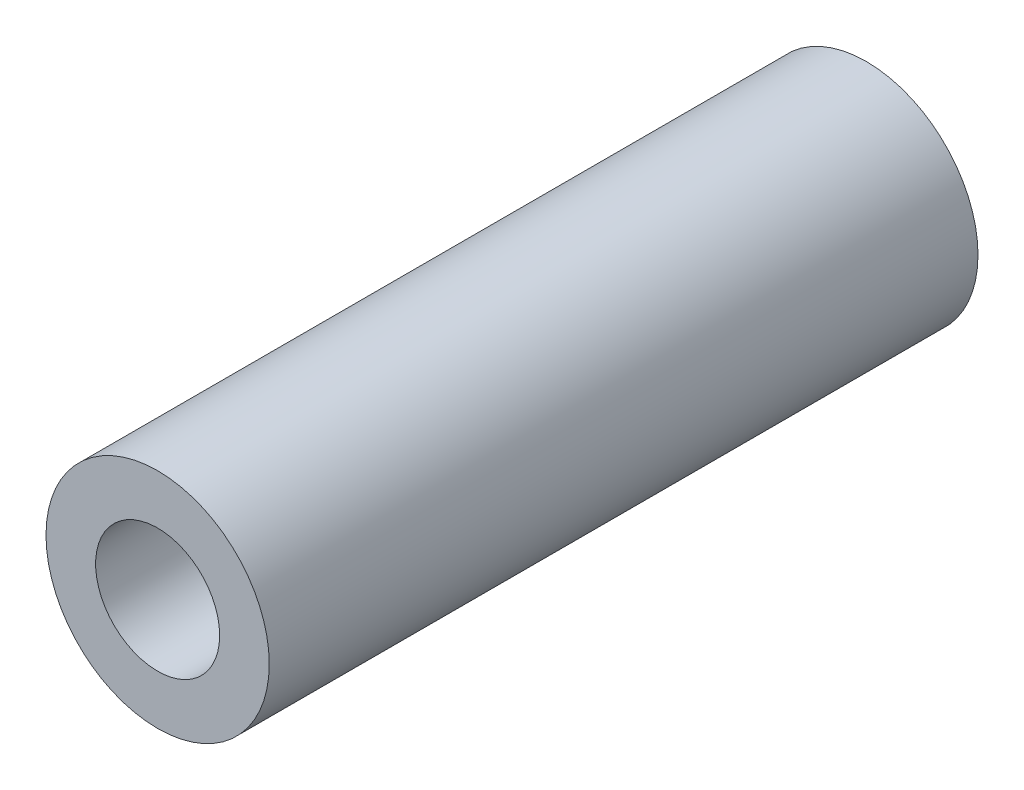
ISO-10303-21;
HEADER;
FILE_DESCRIPTION(('STEP AP214'),'2;1');
FILE_NAME('part.step','',(''),(''),'','','');
FILE_SCHEMA(('AUTOMOTIVE_DESIGN { 1 0 10303 214 1 1 1 1 }'));
ENDSEC;
DATA;
#1=APPLICATION_CONTEXT('core data for automotive mechanical design processes');
#2=APPLICATION_PROTOCOL_DEFINITION('international standard','automotive_design',2000,#1);
#3=PRODUCT_CONTEXT('',#1,'mechanical');
#4=PRODUCT('Part','Part','',(#3));
#5=PRODUCT_RELATED_PRODUCT_CATEGORY('part','',(#4));
#6=PRODUCT_DEFINITION_FORMATION('','',#4);
#7=PRODUCT_DEFINITION_CONTEXT('part definition',#1,'design');
#8=PRODUCT_DEFINITION('design','',#6,#7);
#9=PRODUCT_DEFINITION_SHAPE('','',#8);
#10=(LENGTH_UNIT() NAMED_UNIT(*) SI_UNIT(.MILLI.,.METRE.));
#11=(NAMED_UNIT(*) PLANE_ANGLE_UNIT() SI_UNIT($,.RADIAN.));
#12=(NAMED_UNIT(*) SI_UNIT($,.STERADIAN.) SOLID_ANGLE_UNIT());
#13=UNCERTAINTY_MEASURE_WITH_UNIT(LENGTH_MEASURE(1.E-05),#10,'distance_accuracy_value','');
#14=(GEOMETRIC_REPRESENTATION_CONTEXT(3) GLOBAL_UNCERTAINTY_ASSIGNED_CONTEXT((#13)) GLOBAL_UNIT_ASSIGNED_CONTEXT((#10,
#11,#12)) REPRESENTATION_CONTEXT('',''));
#15=CARTESIAN_POINT('',(0.,0.,0.));
#16=DIRECTION('',(0.,0.,1.));
#17=DIRECTION('',(1.,0.,0.));
#18=AXIS2_PLACEMENT_3D('',#15,#16,#17);
#19=CARTESIAN_POINT('',(0.,0.,20.));
#20=DIRECTION('',(0.,0.,1.));
#21=DIRECTION('',(1.,0.,0.));
#22=AXIS2_PLACEMENT_3D('',#19,#20,#21);
#23=PLANE('',#22);
#24=CARTESIAN_POINT('',(0.,0.,20.));
#25=DIRECTION('',(0.,0.,1.));
#26=DIRECTION('',(1.,0.,0.));
#27=AXIS2_PLACEMENT_3D('',#24,#25,#26);
#28=CIRCLE('',#27,3.15);
#29=CARTESIAN_POINT('',(3.15,0.,20.));
#30=VERTEX_POINT('',#29);
#31=EDGE_CURVE('E10',#30,#30,#28,.T.);
#32=ORIENTED_EDGE('',*,*,#31,.T.);
#33=EDGE_LOOP('',(#32));
#34=FACE_BOUND('',#33,.T.);
#35=CARTESIAN_POINT('',(0.,0.,20.));
#36=DIRECTION('',(0.,0.,1.));
#37=DIRECTION('',(1.,0.,0.));
#38=AXIS2_PLACEMENT_3D('',#35,#36,#37);
#39=CIRCLE('',#38,1.75);
#40=CARTESIAN_POINT('',(1.75,0.,20.));
#41=VERTEX_POINT('',#40);
#42=EDGE_CURVE('E42',#41,#41,#39,.T.);
#43=ORIENTED_EDGE('',*,*,#42,.F.);
#44=EDGE_LOOP('',(#43));
#45=FACE_BOUND('',#44,.T.);
#46=ADVANCED_FACE('F31',(#34,#45),#23,.T.);
#47=CARTESIAN_POINT('',(0.,0.,0.));
#48=DIRECTION('',(0.,0.,1.));
#49=DIRECTION('',(1.,0.,0.));
#50=AXIS2_PLACEMENT_3D('',#47,#48,#49);
#51=PLANE('',#50);
#52=CARTESIAN_POINT('',(0.,0.,0.));
#53=DIRECTION('',(0.,0.,1.));
#54=DIRECTION('',(1.,0.,0.));
#55=AXIS2_PLACEMENT_3D('',#52,#53,#54);
#56=CIRCLE('',#55,3.15);
#57=CARTESIAN_POINT('',(3.15,0.,0.));
#58=VERTEX_POINT('',#57);
#59=EDGE_CURVE('E35',#58,#58,#56,.T.);
#60=ORIENTED_EDGE('',*,*,#59,.F.);
#61=EDGE_LOOP('',(#60));
#62=FACE_BOUND('',#61,.T.);
#63=CARTESIAN_POINT('',(0.,0.,0.));
#64=DIRECTION('',(0.,0.,1.));
#65=DIRECTION('',(1.,0.,0.));
#66=AXIS2_PLACEMENT_3D('',#63,#64,#65);
#67=CIRCLE('',#66,1.75);
#68=CARTESIAN_POINT('',(1.75,0.,0.));
#69=VERTEX_POINT('',#68);
#70=EDGE_CURVE('E44',#69,#69,#67,.T.);
#71=ORIENTED_EDGE('',*,*,#70,.T.);
#72=EDGE_LOOP('',(#71));
#73=FACE_BOUND('',#72,.T.);
#74=ADVANCED_FACE('F54',(#62,#73),#51,.F.);
#75=CARTESIAN_POINT('',(0.,0.,20.));
#76=DIRECTION('',(0.,0.,-1.));
#77=DIRECTION('',(-1.,0.,0.));
#78=AXIS2_PLACEMENT_3D('',#75,#76,#77);
#79=CYLINDRICAL_SURFACE('',#78,3.15);
#80=ORIENTED_EDGE('',*,*,#31,.F.);
#81=EDGE_LOOP('',(#80));
#82=FACE_BOUND('',#81,.T.);
#83=ORIENTED_EDGE('',*,*,#59,.T.);
#84=EDGE_LOOP('',(#83));
#85=FACE_BOUND('',#84,.T.);
#86=ADVANCED_FACE('F33',(#82,#85),#79,.T.);
#87=CARTESIAN_POINT('',(0.,0.,20.));
#88=DIRECTION('',(0.,0.,-1.));
#89=DIRECTION('',(-1.,0.,0.));
#90=AXIS2_PLACEMENT_3D('',#87,#88,#89);
#91=CYLINDRICAL_SURFACE('',#90,1.75);
#92=ORIENTED_EDGE('',*,*,#42,.T.);
#93=EDGE_LOOP('',(#92));
#94=FACE_BOUND('',#93,.T.);
#95=ORIENTED_EDGE('',*,*,#70,.F.);
#96=EDGE_LOOP('',(#95));
#97=FACE_BOUND('',#96,.T.);
#98=ADVANCED_FACE('F50',(#94,#97),#91,.F.);
#99=CLOSED_SHELL('',(#46,#74,#86,#98));
#100=MANIFOLD_SOLID_BREP('B2',#99);
#101=ADVANCED_BREP_SHAPE_REPRESENTATION('',(#18,#100),#14);
#102=SHAPE_DEFINITION_REPRESENTATION(#9,#101);
ENDSEC;
END-ISO-10303-21;
